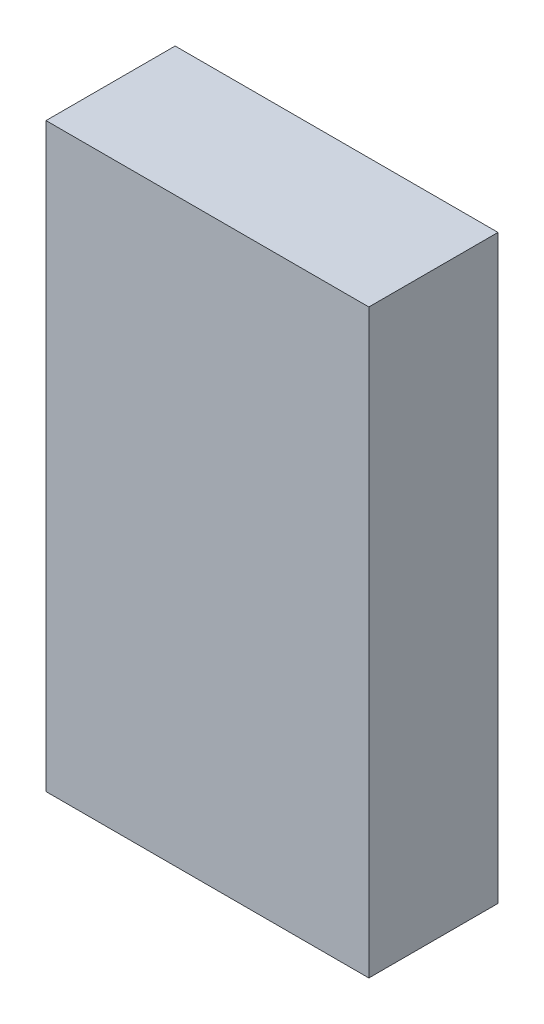
ISO-10303-21;
HEADER;
FILE_DESCRIPTION(('STEP AP214'),'2;1');
FILE_NAME('part.step','',(''),(''),'','','');
FILE_SCHEMA(('AUTOMOTIVE_DESIGN { 1 0 10303 214 1 1 1 1 }'));
ENDSEC;
DATA;
#1=APPLICATION_CONTEXT('core data for automotive mechanical design processes');
#2=APPLICATION_PROTOCOL_DEFINITION('international standard','automotive_design',2000,#1);
#3=PRODUCT_CONTEXT('',#1,'mechanical');
#4=PRODUCT('Part','Part','',(#3));
#5=PRODUCT_RELATED_PRODUCT_CATEGORY('part','',(#4));
#6=PRODUCT_DEFINITION_FORMATION('','',#4);
#7=PRODUCT_DEFINITION_CONTEXT('part definition',#1,'design');
#8=PRODUCT_DEFINITION('design','',#6,#7);
#9=PRODUCT_DEFINITION_SHAPE('','',#8);
#10=(LENGTH_UNIT() NAMED_UNIT(*) SI_UNIT(.MILLI.,.METRE.));
#11=(NAMED_UNIT(*) PLANE_ANGLE_UNIT() SI_UNIT($,.RADIAN.));
#12=(NAMED_UNIT(*) SI_UNIT($,.STERADIAN.) SOLID_ANGLE_UNIT());
#13=UNCERTAINTY_MEASURE_WITH_UNIT(LENGTH_MEASURE(1.E-05),#10,'distance_accuracy_value','');
#14=(GEOMETRIC_REPRESENTATION_CONTEXT(3) GLOBAL_UNCERTAINTY_ASSIGNED_CONTEXT((#13)) GLOBAL_UNIT_ASSIGNED_CONTEXT((#10,
#11,#12)) REPRESENTATION_CONTEXT('',''));
#15=CARTESIAN_POINT('',(0.,0.,0.));
#16=DIRECTION('',(0.,0.,1.));
#17=DIRECTION('',(1.,0.,0.));
#18=AXIS2_PLACEMENT_3D('',#15,#16,#17);
#19=CARTESIAN_POINT('',(-0.625,1.6,0.));
#20=DIRECTION('',(1.,0.,0.));
#21=DIRECTION('',(0.,0.,1.));
#22=AXIS2_PLACEMENT_3D('',#19,#20,#21);
#23=PLANE('',#22);
#24=DIRECTION('',(0.,1.,0.));
#25=VECTOR('',#24,1.);
#26=CARTESIAN_POINT('',(-0.625,1.6,0.1));
#27=LINE('',#26,#25);
#28=CARTESIAN_POINT('',(-0.625,1.6,0.1));
#29=VERTEX_POINT('',#28);
#30=CARTESIAN_POINT('',(-0.625,2.05,0.1));
#31=VERTEX_POINT('',#30);
#32=EDGE_CURVE('E11',#29,#31,#27,.T.);
#33=ORIENTED_EDGE('',*,*,#32,.T.);
#34=DIRECTION('',(0.,0.,1.));
#35=VECTOR('',#34,1.);
#36=CARTESIAN_POINT('',(-0.625,2.05,0.));
#37=LINE('',#36,#35);
#38=CARTESIAN_POINT('',(-0.625,2.05,0.));
#39=VERTEX_POINT('',#38);
#40=EDGE_CURVE('E24',#39,#31,#37,.T.);
#41=ORIENTED_EDGE('',*,*,#40,.F.);
#42=DIRECTION('',(0.,1.,0.));
#43=VECTOR('',#42,1.);
#44=CARTESIAN_POINT('',(-0.625,1.6,0.));
#45=LINE('',#44,#43);
#46=CARTESIAN_POINT('',(-0.625,1.6,0.));
#47=VERTEX_POINT('',#46);
#48=EDGE_CURVE('E86',#47,#39,#45,.T.);
#49=ORIENTED_EDGE('',*,*,#48,.F.);
#50=DIRECTION('',(0.,0.,1.));
#51=VECTOR('',#50,1.);
#52=CARTESIAN_POINT('',(-0.625,1.6,0.));
#53=LINE('',#52,#51);
#54=EDGE_CURVE('E36',#47,#29,#53,.T.);
#55=ORIENTED_EDGE('',*,*,#54,.T.);
#56=EDGE_LOOP('',(#33,#41,#49,#55));
#57=FACE_BOUND('',#56,.T.);
#58=ADVANCED_FACE('F17',(#57),#23,.F.);
#59=CARTESIAN_POINT('',(-0.375,1.6,0.));
#60=DIRECTION('',(1.,0.,0.));
#61=DIRECTION('',(0.,0.,1.));
#62=AXIS2_PLACEMENT_3D('',#59,#60,#61);
#63=PLANE('',#62);
#64=DIRECTION('',(0.,0.,1.));
#65=VECTOR('',#64,1.);
#66=CARTESIAN_POINT('',(-0.375,1.6,0.));
#67=LINE('',#66,#65);
#68=CARTESIAN_POINT('',(-0.375,1.6,0.));
#69=VERTEX_POINT('',#68);
#70=CARTESIAN_POINT('',(-0.375,1.6,0.1));
#71=VERTEX_POINT('',#70);
#72=EDGE_CURVE('E83',#69,#71,#67,.T.);
#73=ORIENTED_EDGE('',*,*,#72,.F.);
#74=DIRECTION('',(0.,1.,0.));
#75=VECTOR('',#74,1.);
#76=CARTESIAN_POINT('',(-0.375,1.6,0.));
#77=LINE('',#76,#75);
#78=CARTESIAN_POINT('',(-0.375,2.05,0.));
#79=VERTEX_POINT('',#78);
#80=EDGE_CURVE('E63',#69,#79,#77,.T.);
#81=ORIENTED_EDGE('',*,*,#80,.T.);
#82=DIRECTION('',(0.,0.,1.));
#83=VECTOR('',#82,1.);
#84=CARTESIAN_POINT('',(-0.375,2.05,0.));
#85=LINE('',#84,#83);
#86=CARTESIAN_POINT('',(-0.375,2.05,0.1));
#87=VERTEX_POINT('',#86);
#88=EDGE_CURVE('E57',#79,#87,#85,.T.);
#89=ORIENTED_EDGE('',*,*,#88,.T.);
#90=DIRECTION('',(0.,1.,0.));
#91=VECTOR('',#90,1.);
#92=CARTESIAN_POINT('',(-0.375,1.6,0.1));
#93=LINE('',#92,#91);
#94=EDGE_CURVE('E60',#71,#87,#93,.T.);
#95=ORIENTED_EDGE('',*,*,#94,.F.);
#96=EDGE_LOOP('',(#73,#81,#89,#95));
#97=FACE_BOUND('',#96,.T.);
#98=ADVANCED_FACE('F59',(#97),#63,.T.);
#99=CARTESIAN_POINT('',(-0.625,1.6,0.));
#100=DIRECTION('',(0.,1.,0.));
#101=DIRECTION('',(0.,0.,1.));
#102=AXIS2_PLACEMENT_3D('',#99,#100,#101);
#103=PLANE('',#102);
#104=ORIENTED_EDGE('',*,*,#72,.T.);
#105=DIRECTION('',(1.,0.,0.));
#106=VECTOR('',#105,1.);
#107=CARTESIAN_POINT('',(-0.625,1.6,0.1));
#108=LINE('',#107,#106);
#109=EDGE_CURVE('E71',#29,#71,#108,.T.);
#110=ORIENTED_EDGE('',*,*,#109,.F.);
#111=ORIENTED_EDGE('',*,*,#54,.F.);
#112=DIRECTION('',(1.,0.,0.));
#113=VECTOR('',#112,1.);
#114=CARTESIAN_POINT('',(-0.625,1.6,0.));
#115=LINE('',#114,#113);
#116=EDGE_CURVE('E76',#47,#69,#115,.T.);
#117=ORIENTED_EDGE('',*,*,#116,.T.);
#118=EDGE_LOOP('',(#104,#110,#111,#117));
#119=FACE_BOUND('',#118,.T.);
#120=ADVANCED_FACE('F91',(#119),#103,.F.);
#121=CARTESIAN_POINT('',(-0.625,2.05,0.));
#122=DIRECTION('',(0.,1.,0.));
#123=DIRECTION('',(0.,0.,1.));
#124=AXIS2_PLACEMENT_3D('',#121,#122,#123);
#125=PLANE('',#124);
#126=DIRECTION('',(1.,0.,0.));
#127=VECTOR('',#126,1.);
#128=CARTESIAN_POINT('',(-0.625,2.05,0.));
#129=LINE('',#128,#127);
#130=EDGE_CURVE('E74',#39,#79,#129,.T.);
#131=ORIENTED_EDGE('',*,*,#130,.F.);
#132=ORIENTED_EDGE('',*,*,#40,.T.);
#133=DIRECTION('',(1.,0.,0.));
#134=VECTOR('',#133,1.);
#135=CARTESIAN_POINT('',(-0.625,2.05,0.1));
#136=LINE('',#135,#134);
#137=EDGE_CURVE('E69',#31,#87,#136,.T.);
#138=ORIENTED_EDGE('',*,*,#137,.T.);
#139=ORIENTED_EDGE('',*,*,#88,.F.);
#140=EDGE_LOOP('',(#131,#132,#138,#139));
#141=FACE_BOUND('',#140,.T.);
#142=ADVANCED_FACE('F73',(#141),#125,.T.);
#143=CARTESIAN_POINT('',(-0.625,1.6,0.));
#144=DIRECTION('',(0.,0.,1.));
#145=DIRECTION('',(1.,0.,0.));
#146=AXIS2_PLACEMENT_3D('',#143,#144,#145);
#147=PLANE('',#146);
#148=ORIENTED_EDGE('',*,*,#130,.T.);
#149=ORIENTED_EDGE('',*,*,#80,.F.);
#150=ORIENTED_EDGE('',*,*,#116,.F.);
#151=ORIENTED_EDGE('',*,*,#48,.T.);
#152=EDGE_LOOP('',(#148,#149,#150,#151));
#153=FACE_BOUND('',#152,.T.);
#154=ADVANCED_FACE('F89',(#153),#147,.F.);
#155=CARTESIAN_POINT('',(-0.625,1.6,0.1));
#156=DIRECTION('',(0.,0.,1.));
#157=DIRECTION('',(1.,0.,0.));
#158=AXIS2_PLACEMENT_3D('',#155,#156,#157);
#159=PLANE('',#158);
#160=ORIENTED_EDGE('',*,*,#32,.F.);
#161=ORIENTED_EDGE('',*,*,#109,.T.);
#162=ORIENTED_EDGE('',*,*,#94,.T.);
#163=ORIENTED_EDGE('',*,*,#137,.F.);
#164=EDGE_LOOP('',(#160,#161,#162,#163));
#165=FACE_BOUND('',#164,.T.);
#166=ADVANCED_FACE('F68',(#165),#159,.T.);
#167=CLOSED_SHELL('',(#58,#98,#120,#142,#154,#166));
#168=MANIFOLD_SOLID_BREP('B1',#167);
#169=ADVANCED_BREP_SHAPE_REPRESENTATION('',(#18,#168),#14);
#170=SHAPE_DEFINITION_REPRESENTATION(#9,#169);
ENDSEC;
END-ISO-10303-21;
